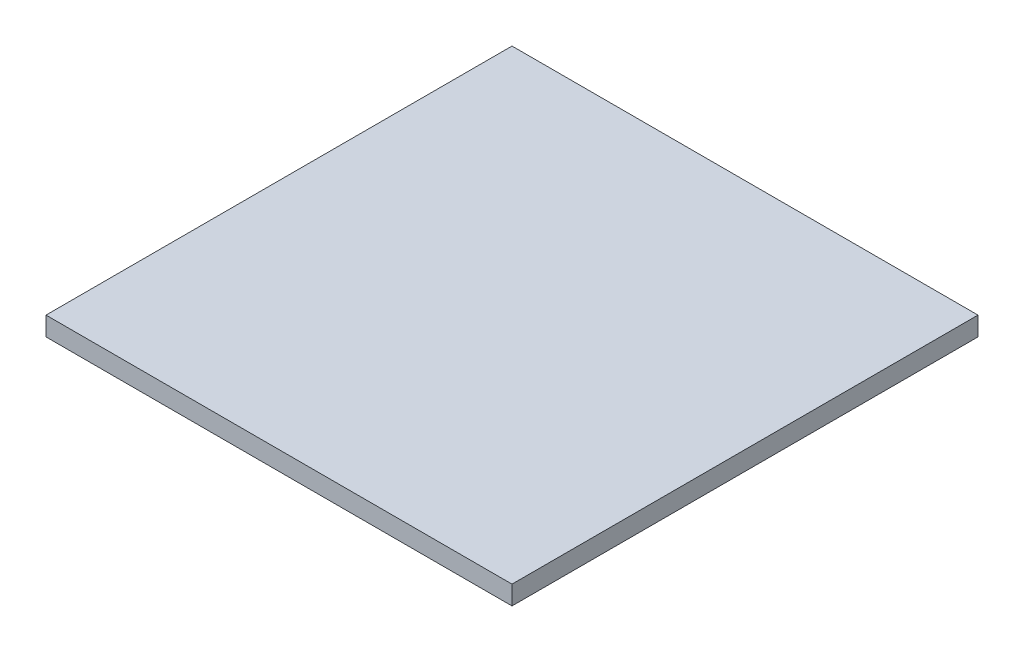
ISO-10303-21;
HEADER;
FILE_DESCRIPTION(('STEP AP214'),'2;1');
FILE_NAME('part.step','',(''),(''),'','','');
FILE_SCHEMA(('AUTOMOTIVE_DESIGN { 1 0 10303 214 1 1 1 1 }'));
ENDSEC;
DATA;
#1=APPLICATION_CONTEXT('core data for automotive mechanical design processes');
#2=APPLICATION_PROTOCOL_DEFINITION('international standard','automotive_design',2000,#1);
#3=PRODUCT_CONTEXT('',#1,'mechanical');
#4=PRODUCT('Part','Part','',(#3));
#5=PRODUCT_RELATED_PRODUCT_CATEGORY('part','',(#4));
#6=PRODUCT_DEFINITION_FORMATION('','',#4);
#7=PRODUCT_DEFINITION_CONTEXT('part definition',#1,'design');
#8=PRODUCT_DEFINITION('design','',#6,#7);
#9=PRODUCT_DEFINITION_SHAPE('','',#8);
#10=(LENGTH_UNIT() NAMED_UNIT(*) SI_UNIT(.MILLI.,.METRE.));
#11=(NAMED_UNIT(*) PLANE_ANGLE_UNIT() SI_UNIT($,.RADIAN.));
#12=(NAMED_UNIT(*) SI_UNIT($,.STERADIAN.) SOLID_ANGLE_UNIT());
#13=UNCERTAINTY_MEASURE_WITH_UNIT(LENGTH_MEASURE(1.E-05),#10,'distance_accuracy_value','');
#14=(GEOMETRIC_REPRESENTATION_CONTEXT(3) GLOBAL_UNCERTAINTY_ASSIGNED_CONTEXT((#13)) GLOBAL_UNIT_ASSIGNED_CONTEXT((#10,
#11,#12)) REPRESENTATION_CONTEXT('',''));
#15=CARTESIAN_POINT('',(0.,0.,0.));
#16=DIRECTION('',(0.,0.,1.));
#17=DIRECTION('',(1.,0.,0.));
#18=AXIS2_PLACEMENT_3D('',#15,#16,#17);
#19=CARTESIAN_POINT('',(25.,2.03,25.));
#20=DIRECTION('',(-1.,0.,0.));
#21=DIRECTION('',(0.,0.,1.));
#22=AXIS2_PLACEMENT_3D('',#19,#20,#21);
#23=PLANE('',#22);
#24=DIRECTION('',(0.,0.,-1.));
#25=VECTOR('',#24,1.);
#26=CARTESIAN_POINT('',(25.,0.,25.));
#27=LINE('',#26,#25);
#28=CARTESIAN_POINT('',(25.,0.,25.));
#29=VERTEX_POINT('',#28);
#30=CARTESIAN_POINT('',(25.,0.,-25.));
#31=VERTEX_POINT('',#30);
#32=EDGE_CURVE('E98',#29,#31,#27,.T.);
#33=ORIENTED_EDGE('',*,*,#32,.T.);
#34=DIRECTION('',(0.,-1.,0.));
#35=VECTOR('',#34,1.);
#36=CARTESIAN_POINT('',(25.,2.03,-25.));
#37=LINE('',#36,#35);
#38=CARTESIAN_POINT('',(25.,2.03,-25.));
#39=VERTEX_POINT('',#38);
#40=EDGE_CURVE('E11',#39,#31,#37,.T.);
#41=ORIENTED_EDGE('',*,*,#40,.F.);
#42=DIRECTION('',(0.,0.,-1.));
#43=VECTOR('',#42,1.);
#44=CARTESIAN_POINT('',(25.,2.03,25.));
#45=LINE('',#44,#43);
#46=CARTESIAN_POINT('',(25.,2.03,25.));
#47=VERTEX_POINT('',#46);
#48=EDGE_CURVE('E86',#47,#39,#45,.T.);
#49=ORIENTED_EDGE('',*,*,#48,.F.);
#50=DIRECTION('',(0.,-1.,0.));
#51=VECTOR('',#50,1.);
#52=CARTESIAN_POINT('',(25.,2.03,25.));
#53=LINE('',#52,#51);
#54=EDGE_CURVE('E94',#47,#29,#53,.T.);
#55=ORIENTED_EDGE('',*,*,#54,.T.);
#56=EDGE_LOOP('',(#33,#41,#49,#55));
#57=FACE_BOUND('',#56,.T.);
#58=ADVANCED_FACE('F35',(#57),#23,.F.);
#59=CARTESIAN_POINT('',(-25.,2.03,-25.));
#60=DIRECTION('',(0.,0.,1.));
#61=DIRECTION('',(1.,0.,0.));
#62=AXIS2_PLACEMENT_3D('',#59,#60,#61);
#63=PLANE('',#62);
#64=DIRECTION('',(-1.,0.,0.));
#65=VECTOR('',#64,1.);
#66=CARTESIAN_POINT('',(-25.,0.,-25.));
#67=LINE('',#66,#65);
#68=CARTESIAN_POINT('',(-25.,0.,-25.));
#69=VERTEX_POINT('',#68);
#70=EDGE_CURVE('E90',#31,#69,#67,.T.);
#71=ORIENTED_EDGE('',*,*,#70,.T.);
#72=DIRECTION('',(0.,-1.,0.));
#73=VECTOR('',#72,1.);
#74=CARTESIAN_POINT('',(-25.,2.03,-25.));
#75=LINE('',#74,#73);
#76=CARTESIAN_POINT('',(-25.,2.03,-25.));
#77=VERTEX_POINT('',#76);
#78=EDGE_CURVE('E43',#77,#69,#75,.T.);
#79=ORIENTED_EDGE('',*,*,#78,.F.);
#80=DIRECTION('',(-1.,0.,0.));
#81=VECTOR('',#80,1.);
#82=CARTESIAN_POINT('',(-25.,2.03,-25.));
#83=LINE('',#82,#81);
#84=EDGE_CURVE('E81',#39,#77,#83,.T.);
#85=ORIENTED_EDGE('',*,*,#84,.F.);
#86=ORIENTED_EDGE('',*,*,#40,.T.);
#87=EDGE_LOOP('',(#71,#79,#85,#86));
#88=FACE_BOUND('',#87,.T.);
#89=ADVANCED_FACE('F89',(#88),#63,.F.);
#90=CARTESIAN_POINT('',(-25.,2.03,25.));
#91=DIRECTION('',(1.,0.,0.));
#92=DIRECTION('',(0.,0.,-1.));
#93=AXIS2_PLACEMENT_3D('',#90,#91,#92);
#94=PLANE('',#93);
#95=DIRECTION('',(0.,0.,1.));
#96=VECTOR('',#95,1.);
#97=CARTESIAN_POINT('',(-25.,0.,25.));
#98=LINE('',#97,#96);
#99=CARTESIAN_POINT('',(-25.,0.,25.));
#100=VERTEX_POINT('',#99);
#101=EDGE_CURVE('E68',#69,#100,#98,.T.);
#102=ORIENTED_EDGE('',*,*,#101,.T.);
#103=DIRECTION('',(0.,-1.,0.));
#104=VECTOR('',#103,1.);
#105=CARTESIAN_POINT('',(-25.,2.03,25.));
#106=LINE('',#105,#104);
#107=CARTESIAN_POINT('',(-25.,2.03,25.));
#108=VERTEX_POINT('',#107);
#109=EDGE_CURVE('E91',#108,#100,#106,.T.);
#110=ORIENTED_EDGE('',*,*,#109,.F.);
#111=DIRECTION('',(0.,0.,1.));
#112=VECTOR('',#111,1.);
#113=CARTESIAN_POINT('',(-25.,2.03,25.));
#114=LINE('',#113,#112);
#115=EDGE_CURVE('E84',#77,#108,#114,.T.);
#116=ORIENTED_EDGE('',*,*,#115,.F.);
#117=ORIENTED_EDGE('',*,*,#78,.T.);
#118=EDGE_LOOP('',(#102,#110,#116,#117));
#119=FACE_BOUND('',#118,.T.);
#120=ADVANCED_FACE('F92',(#119),#94,.F.);
#121=CARTESIAN_POINT('',(-25.,2.03,25.));
#122=DIRECTION('',(0.,0.,-1.));
#123=DIRECTION('',(-1.,0.,0.));
#124=AXIS2_PLACEMENT_3D('',#121,#122,#123);
#125=PLANE('',#124);
#126=DIRECTION('',(1.,0.,0.));
#127=VECTOR('',#126,1.);
#128=CARTESIAN_POINT('',(-25.,0.,25.));
#129=LINE('',#128,#127);
#130=EDGE_CURVE('E74',#100,#29,#129,.T.);
#131=ORIENTED_EDGE('',*,*,#130,.T.);
#132=ORIENTED_EDGE('',*,*,#54,.F.);
#133=DIRECTION('',(1.,0.,0.));
#134=VECTOR('',#133,1.);
#135=CARTESIAN_POINT('',(-25.,2.03,25.));
#136=LINE('',#135,#134);
#137=EDGE_CURVE('E51',#108,#47,#136,.T.);
#138=ORIENTED_EDGE('',*,*,#137,.F.);
#139=ORIENTED_EDGE('',*,*,#109,.T.);
#140=EDGE_LOOP('',(#131,#132,#138,#139));
#141=FACE_BOUND('',#140,.T.);
#142=ADVANCED_FACE('F105',(#141),#125,.F.);
#143=CARTESIAN_POINT('',(0.,2.03,0.));
#144=DIRECTION('',(0.,-1.,0.));
#145=DIRECTION('',(0.,0.,-1.));
#146=AXIS2_PLACEMENT_3D('',#143,#144,#145);
#147=PLANE('',#146);
#148=ORIENTED_EDGE('',*,*,#48,.T.);
#149=ORIENTED_EDGE('',*,*,#84,.T.);
#150=ORIENTED_EDGE('',*,*,#115,.T.);
#151=ORIENTED_EDGE('',*,*,#137,.T.);
#152=EDGE_LOOP('',(#148,#149,#150,#151));
#153=FACE_BOUND('',#152,.T.);
#154=ADVANCED_FACE('F82',(#153),#147,.F.);
#155=CARTESIAN_POINT('',(0.,0.,0.));
#156=DIRECTION('',(0.,-1.,0.));
#157=DIRECTION('',(0.,0.,-1.));
#158=AXIS2_PLACEMENT_3D('',#155,#156,#157);
#159=PLANE('',#158);
#160=ORIENTED_EDGE('',*,*,#32,.F.);
#161=ORIENTED_EDGE('',*,*,#130,.F.);
#162=ORIENTED_EDGE('',*,*,#101,.F.);
#163=ORIENTED_EDGE('',*,*,#70,.F.);
#164=EDGE_LOOP('',(#160,#161,#162,#163));
#165=FACE_BOUND('',#164,.T.);
#166=ADVANCED_FACE('F108',(#165),#159,.T.);
#167=CLOSED_SHELL('',(#58,#89,#120,#142,#154,#166));
#168=MANIFOLD_SOLID_BREP('B2',#167);
#169=ADVANCED_BREP_SHAPE_REPRESENTATION('',(#18,#168),#14);
#170=SHAPE_DEFINITION_REPRESENTATION(#9,#169);
ENDSEC;
END-ISO-10303-21;
